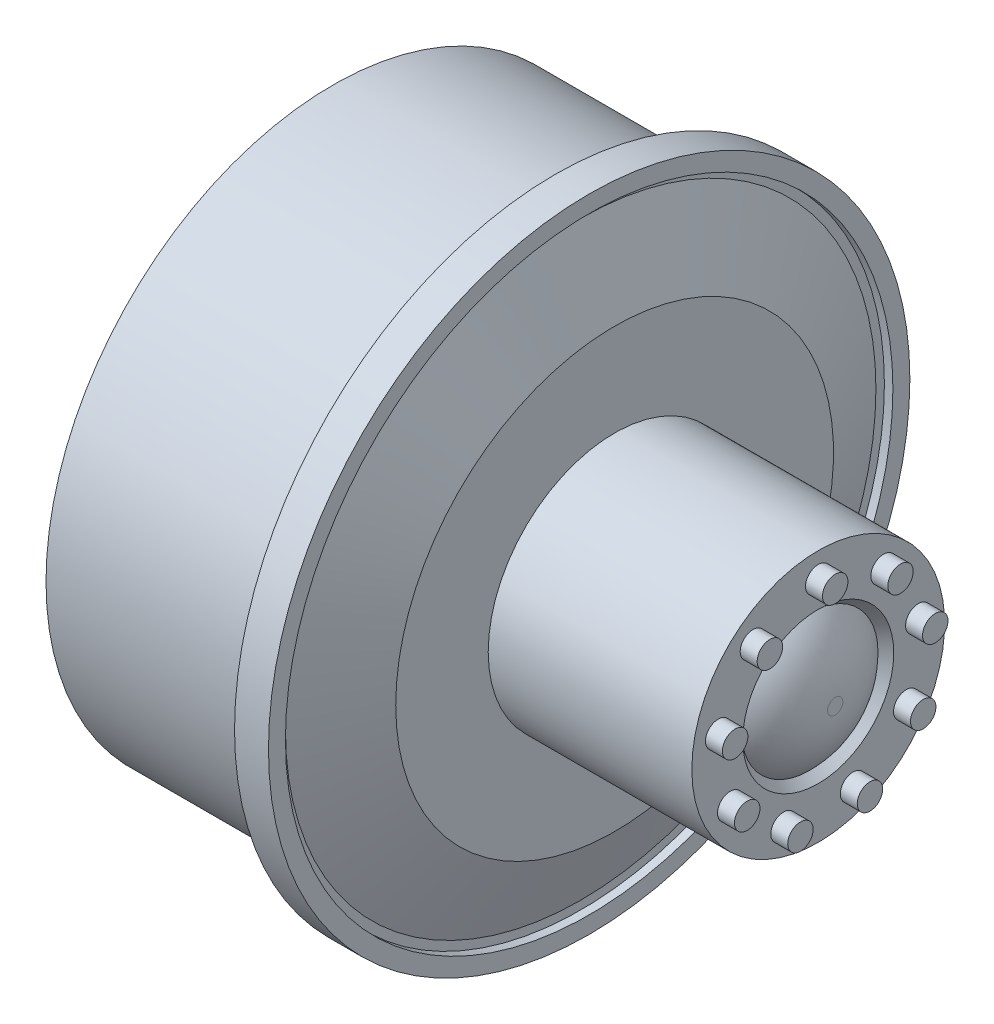
ISO-10303-21;
HEADER;
FILE_DESCRIPTION(('STEP AP214'),'2;1');
FILE_NAME('part.step','',(''),(''),'','','');
FILE_SCHEMA(('AUTOMOTIVE_DESIGN { 1 0 10303 214 1 1 1 1 }'));
ENDSEC;
DATA;
#1=APPLICATION_CONTEXT('core data for automotive mechanical design processes');
#2=APPLICATION_PROTOCOL_DEFINITION('international standard','automotive_design',2000,#1);
#3=PRODUCT_CONTEXT('',#1,'mechanical');
#4=PRODUCT('Part','Part','',(#3));
#5=PRODUCT_RELATED_PRODUCT_CATEGORY('part','',(#4));
#6=PRODUCT_DEFINITION_FORMATION('','',#4);
#7=PRODUCT_DEFINITION_CONTEXT('part definition',#1,'design');
#8=PRODUCT_DEFINITION('design','',#6,#7);
#9=PRODUCT_DEFINITION_SHAPE('','',#8);
#10=(LENGTH_UNIT() NAMED_UNIT(*) SI_UNIT(.MILLI.,.METRE.));
#11=(NAMED_UNIT(*) PLANE_ANGLE_UNIT() SI_UNIT($,.RADIAN.));
#12=(NAMED_UNIT(*) SI_UNIT($,.STERADIAN.) SOLID_ANGLE_UNIT());
#13=UNCERTAINTY_MEASURE_WITH_UNIT(LENGTH_MEASURE(1.E-05),#10,'distance_accuracy_value','');
#14=(GEOMETRIC_REPRESENTATION_CONTEXT(3) GLOBAL_UNCERTAINTY_ASSIGNED_CONTEXT((#13)) GLOBAL_UNIT_ASSIGNED_CONTEXT((#10,
#11,#12)) REPRESENTATION_CONTEXT('',''));
#15=CARTESIAN_POINT('',(0.,0.,0.));
#16=DIRECTION('',(0.,0.,1.));
#17=DIRECTION('',(1.,0.,0.));
#18=AXIS2_PLACEMENT_3D('',#15,#16,#17);
#19=CARTESIAN_POINT('',(-37.2788661687838,0.,0.));
#20=DIRECTION('',(-1.,0.,0.));
#21=DIRECTION('',(0.,0.,1.));
#22=AXIS2_PLACEMENT_3D('',#19,#20,#21);
#23=CYLINDRICAL_SURFACE('',#22,7.45);
#24=CARTESIAN_POINT('',(12.1398131593203,0.,0.));
#25=DIRECTION('',(-1.,0.,0.));
#26=DIRECTION('',(0.,0.,1.));
#27=AXIS2_PLACEMENT_3D('',#24,#25,#26);
#28=CIRCLE('',#27,7.45);
#29=CARTESIAN_POINT('',(12.1398131593203,0.,7.45));
#30=VERTEX_POINT('',#29);
#31=EDGE_CURVE('E99',#30,#30,#28,.T.);
#32=ORIENTED_EDGE('',*,*,#31,.F.);
#33=EDGE_LOOP('',(#32));
#34=FACE_BOUND('',#33,.T.);
#35=CARTESIAN_POINT('',(24.1398131593203,0.,0.));
#36=DIRECTION('',(-1.,0.,0.));
#37=DIRECTION('',(0.,0.,1.));
#38=AXIS2_PLACEMENT_3D('',#35,#36,#37);
#39=CIRCLE('',#38,7.45);
#40=CARTESIAN_POINT('',(24.1398131593203,0.,7.45));
#41=VERTEX_POINT('',#40);
#42=EDGE_CURVE('E69',#41,#41,#39,.T.);
#43=ORIENTED_EDGE('',*,*,#42,.T.);
#44=EDGE_LOOP('',(#43));
#45=FACE_BOUND('',#44,.T.);
#46=ADVANCED_FACE('F31',(#34,#45),#23,.T.);
#47=CARTESIAN_POINT('',(24.1398131593203,0.,-7.45));
#48=DIRECTION('',(-1.,0.,0.));
#49=DIRECTION('',(0.,0.,1.));
#50=AXIS2_PLACEMENT_3D('',#47,#48,#49);
#51=PLANE('',#50);
#52=CARTESIAN_POINT('',(24.1398131593203,4.58711732687269,3.84904845714596));
#53=DIRECTION('',(-1.,0.,0.));
#54=DIRECTION('',(0.,0.,1.));
#55=AXIS2_PLACEMENT_3D('',#52,#53,#54);
#56=CIRCLE('',#55,0.750000000000316);
#57=CARTESIAN_POINT('',(24.1398131593203,4.58711732687269,4.59904845714628));
#58=VERTEX_POINT('',#57);
#59=EDGE_CURVE('E38',#58,#58,#56,.F.);
#60=ORIENTED_EDGE('',*,*,#59,.F.);
#61=EDGE_LOOP('',(#60));
#62=FACE_BOUND('',#61,.T.);
#63=CARTESIAN_POINT('',(24.1398131593203,1.0398150808487,5.8970843637844));
#64=DIRECTION('',(-1.,0.,0.));
#65=DIRECTION('',(0.,0.,1.));
#66=AXIS2_PLACEMENT_3D('',#63,#64,#65);
#67=CIRCLE('',#66,0.750000000000701);
#68=CARTESIAN_POINT('',(24.1398131593203,1.0398150808487,6.64708436378511));
#69=VERTEX_POINT('',#68);
#70=EDGE_CURVE('E42',#69,#69,#67,.F.);
#71=ORIENTED_EDGE('',*,*,#70,.F.);
#72=EDGE_LOOP('',(#71));
#73=FACE_BOUND('',#72,.T.);
#74=CARTESIAN_POINT('',(24.1398131593203,-2.99402819776177,5.18580895781547));
#75=DIRECTION('',(-1.,0.,0.));
#76=DIRECTION('',(0.,0.,1.));
#77=AXIS2_PLACEMENT_3D('',#74,#75,#76);
#78=CIRCLE('',#77,0.750000000001059);
#79=CARTESIAN_POINT('',(24.1398131593203,-2.99402819776177,5.93580895781653));
#80=VERTEX_POINT('',#79);
#81=EDGE_CURVE('E46',#80,#80,#78,.F.);
#82=ORIENTED_EDGE('',*,*,#81,.F.);
#83=EDGE_LOOP('',(#82));
#84=FACE_BOUND('',#83,.T.);
#85=CARTESIAN_POINT('',(24.1398131593203,-5.62693240772256,2.04803590663764));
#86=DIRECTION('',(-1.,0.,0.));
#87=DIRECTION('',(0.,0.,1.));
#88=AXIS2_PLACEMENT_3D('',#85,#86,#87);
#89=CIRCLE('',#88,0.750000000001205);
#90=CARTESIAN_POINT('',(24.1398131593203,-5.62693240772256,2.79803590663884));
#91=VERTEX_POINT('',#90);
#92=EDGE_CURVE('E51',#91,#91,#89,.F.);
#93=ORIENTED_EDGE('',*,*,#92,.F.);
#94=EDGE_LOOP('',(#93));
#95=FACE_BOUND('',#94,.T.);
#96=CARTESIAN_POINT('',(24.1398131593203,-5.62693240772216,-2.04803590663995));
#97=DIRECTION('',(-1.,0.,0.));
#98=DIRECTION('',(0.,0.,1.));
#99=AXIS2_PLACEMENT_3D('',#96,#97,#98);
#100=CIRCLE('',#99,0.750000000001078);
#101=CARTESIAN_POINT('',(24.1398131593203,-5.62693240772216,-1.29803590663887));
#102=VERTEX_POINT('',#101);
#103=EDGE_CURVE('E54',#102,#102,#100,.F.);
#104=ORIENTED_EDGE('',*,*,#103,.F.);
#105=EDGE_LOOP('',(#104));
#106=FACE_BOUND('',#105,.T.);
#107=CARTESIAN_POINT('',(24.1398131593203,-2.99402819776073,-5.18580895781726));
#108=DIRECTION('',(-1.,0.,0.));
#109=DIRECTION('',(0.,0.,1.));
#110=AXIS2_PLACEMENT_3D('',#107,#108,#109);
#111=CIRCLE('',#110,0.75000000000073);
#112=CARTESIAN_POINT('',(24.1398131593203,-2.99402819776073,-4.43580895781653));
#113=VERTEX_POINT('',#112);
#114=EDGE_CURVE('E57',#113,#113,#111,.F.);
#115=ORIENTED_EDGE('',*,*,#114,.F.);
#116=EDGE_LOOP('',(#115));
#117=FACE_BOUND('',#116,.T.);
#118=CARTESIAN_POINT('',(24.1398131593203,1.03981508084988,-5.89708436378539));
#119=DIRECTION('',(-1.,0.,0.));
#120=DIRECTION('',(0.,0.,1.));
#121=AXIS2_PLACEMENT_3D('',#118,#119,#120);
#122=CIRCLE('',#121,0.750000000000317);
#123=CARTESIAN_POINT('',(24.1398131593203,1.03981508084988,-5.14708436378507));
#124=VERTEX_POINT('',#123);
#125=EDGE_CURVE('E60',#124,#124,#122,.F.);
#126=ORIENTED_EDGE('',*,*,#125,.F.);
#127=EDGE_LOOP('',(#126));
#128=FACE_BOUND('',#127,.T.);
#129=CARTESIAN_POINT('',(24.1398131593203,4.58711732687345,-3.84904845714624));
#130=DIRECTION('',(-1.,0.,0.));
#131=DIRECTION('',(0.,0.,1.));
#132=AXIS2_PLACEMENT_3D('',#129,#130,#131);
#133=CIRCLE('',#132,0.75000000000003);
#134=CARTESIAN_POINT('',(24.1398131593203,4.58711732687345,-3.09904845714621));
#135=VERTEX_POINT('',#134);
#136=EDGE_CURVE('E63',#135,#135,#133,.F.);
#137=ORIENTED_EDGE('',*,*,#136,.F.);
#138=EDGE_LOOP('',(#137));
#139=FACE_BOUND('',#138,.T.);
#140=CARTESIAN_POINT('',(24.1398131593203,5.9880563955225,0.));
#141=DIRECTION('',(-1.,0.,0.));
#142=DIRECTION('',(0.,0.,1.));
#143=AXIS2_PLACEMENT_3D('',#140,#141,#142);
#144=CIRCLE('',#143,0.75);
#145=CARTESIAN_POINT('',(24.1398131593203,5.9880563955225,0.75));
#146=VERTEX_POINT('',#145);
#147=EDGE_CURVE('E66',#146,#146,#144,.F.);
#148=ORIENTED_EDGE('',*,*,#147,.F.);
#149=EDGE_LOOP('',(#148));
#150=FACE_BOUND('',#149,.T.);
#151=ORIENTED_EDGE('',*,*,#42,.F.);
#152=EDGE_LOOP('',(#151));
#153=FACE_BOUND('',#152,.T.);
#154=CARTESIAN_POINT('',(24.1398131593203,0.,0.));
#155=DIRECTION('',(-1.,0.,0.));
#156=DIRECTION('',(0.,0.,1.));
#157=AXIS2_PLACEMENT_3D('',#154,#155,#156);
#158=CIRCLE('',#157,4.45);
#159=CARTESIAN_POINT('',(24.1398131593203,0.,4.45));
#160=VERTEX_POINT('',#159);
#161=EDGE_CURVE('E72',#160,#160,#158,.T.);
#162=ORIENTED_EDGE('',*,*,#161,.T.);
#163=EDGE_LOOP('',(#162));
#164=FACE_BOUND('',#163,.T.);
#165=ADVANCED_FACE('F144',(#62,#73,#84,#95,#106,#117,#128,#139,#150,#153,#164),#51,.F.);
#166=CARTESIAN_POINT('',(23.6398131593203,0.,0.));
#167=DIRECTION('',(1.,0.,0.));
#168=DIRECTION('',(0.,0.,-1.));
#169=AXIS2_PLACEMENT_3D('',#166,#167,#168);
#170=CONICAL_SURFACE('',#169,4.02142857142857,0.708626272127667);
#171=ORIENTED_EDGE('',*,*,#161,.F.);
#172=EDGE_LOOP('',(#171));
#173=FACE_BOUND('',#172,.T.);
#174=CARTESIAN_POINT('',(23.6398131593203,0.,0.));
#175=DIRECTION('',(1.,0.,0.));
#176=DIRECTION('',(0.,0.,-1.));
#177=AXIS2_PLACEMENT_3D('',#174,#175,#176);
#178=CIRCLE('',#177,4.02142857142857);
#179=CARTESIAN_POINT('',(23.6398131593203,0.,-4.02142857142857));
#180=VERTEX_POINT('',#179);
#181=EDGE_CURVE('E133',#180,#180,#178,.T.);
#182=ORIENTED_EDGE('',*,*,#181,.F.);
#183=EDGE_LOOP('',(#182));
#184=FACE_BOUND('',#183,.T.);
#185=ADVANCED_FACE('F141',(#173,#184),#170,.F.);
#186=CARTESIAN_POINT('',(-4.47018684067971,0.,-16.9));
#187=DIRECTION('',(1.,0.,0.));
#188=DIRECTION('',(0.,0.,-1.));
#189=AXIS2_PLACEMENT_3D('',#186,#187,#188);
#190=PLANE('',#189);
#191=CARTESIAN_POINT('',(-4.47018684067971,0.,0.));
#192=DIRECTION('',(-1.,0.,0.));
#193=DIRECTION('',(0.,0.,1.));
#194=AXIS2_PLACEMENT_3D('',#191,#192,#193);
#195=CIRCLE('',#194,10.5);
#196=CARTESIAN_POINT('',(-4.47018684067971,0.,10.5));
#197=VERTEX_POINT('',#196);
#198=EDGE_CURVE('E130',#197,#197,#195,.T.);
#199=ORIENTED_EDGE('',*,*,#198,.F.);
#200=EDGE_LOOP('',(#199));
#201=FACE_BOUND('',#200,.T.);
#202=CARTESIAN_POINT('',(-4.47018684067971,0.,0.));
#203=DIRECTION('',(-1.,0.,0.));
#204=DIRECTION('',(0.,0.,1.));
#205=AXIS2_PLACEMENT_3D('',#202,#203,#204);
#206=CIRCLE('',#205,16.9);
#207=CARTESIAN_POINT('',(-4.47018684067971,0.,16.9));
#208=VERTEX_POINT('',#207);
#209=EDGE_CURVE('E75',#208,#208,#206,.T.);
#210=ORIENTED_EDGE('',*,*,#209,.T.);
#211=EDGE_LOOP('',(#210));
#212=FACE_BOUND('',#211,.T.);
#213=ADVANCED_FACE('F143',(#201,#212),#190,.F.);
#214=CARTESIAN_POINT('',(-37.2788661687838,0.,0.));
#215=DIRECTION('',(-1.,0.,0.));
#216=DIRECTION('',(0.,0.,1.));
#217=AXIS2_PLACEMENT_3D('',#214,#215,#216);
#218=CYLINDRICAL_SURFACE('',#217,16.9);
#219=ORIENTED_EDGE('',*,*,#209,.F.);
#220=EDGE_LOOP('',(#219));
#221=FACE_BOUND('',#220,.T.);
#222=CARTESIAN_POINT('',(8.63981315932029,0.,0.));
#223=DIRECTION('',(-1.,0.,0.));
#224=DIRECTION('',(0.,0.,1.));
#225=AXIS2_PLACEMENT_3D('',#222,#223,#224);
#226=CIRCLE('',#225,16.9);
#227=CARTESIAN_POINT('',(8.63981315932029,0.,16.9));
#228=VERTEX_POINT('',#227);
#229=EDGE_CURVE('E78',#228,#228,#226,.T.);
#230=ORIENTED_EDGE('',*,*,#229,.T.);
#231=EDGE_LOOP('',(#230));
#232=FACE_BOUND('',#231,.T.);
#233=ADVANCED_FACE('F151',(#221,#232),#218,.T.);
#234=CARTESIAN_POINT('',(8.63981315932029,0.,-18.9));
#235=DIRECTION('',(1.,0.,0.));
#236=DIRECTION('',(0.,0.,-1.));
#237=AXIS2_PLACEMENT_3D('',#234,#235,#236);
#238=PLANE('',#237);
#239=ORIENTED_EDGE('',*,*,#229,.F.);
#240=EDGE_LOOP('',(#239));
#241=FACE_BOUND('',#240,.T.);
#242=CARTESIAN_POINT('',(8.63981315932029,0.,0.));
#243=DIRECTION('',(-1.,0.,0.));
#244=DIRECTION('',(0.,0.,1.));
#245=AXIS2_PLACEMENT_3D('',#242,#243,#244);
#246=CIRCLE('',#245,18.9);
#247=CARTESIAN_POINT('',(8.63981315932029,0.,18.9));
#248=VERTEX_POINT('',#247);
#249=EDGE_CURVE('E81',#248,#248,#246,.T.);
#250=ORIENTED_EDGE('',*,*,#249,.T.);
#251=EDGE_LOOP('',(#250));
#252=FACE_BOUND('',#251,.T.);
#253=ADVANCED_FACE('F200',(#241,#252),#238,.F.);
#254=CARTESIAN_POINT('',(-37.2788661687838,0.,0.));
#255=DIRECTION('',(-1.,0.,0.));
#256=DIRECTION('',(0.,0.,1.));
#257=AXIS2_PLACEMENT_3D('',#254,#255,#256);
#258=CYLINDRICAL_SURFACE('',#257,18.9);
#259=ORIENTED_EDGE('',*,*,#249,.F.);
#260=EDGE_LOOP('',(#259));
#261=FACE_BOUND('',#260,.T.);
#262=CARTESIAN_POINT('',(10.6398131593203,0.,0.));
#263=DIRECTION('',(-1.,0.,0.));
#264=DIRECTION('',(0.,0.,1.));
#265=AXIS2_PLACEMENT_3D('',#262,#263,#264);
#266=CIRCLE('',#265,18.9);
#267=CARTESIAN_POINT('',(10.6398131593203,0.,18.9));
#268=VERTEX_POINT('',#267);
#269=EDGE_CURVE('E84',#268,#268,#266,.T.);
#270=ORIENTED_EDGE('',*,*,#269,.T.);
#271=EDGE_LOOP('',(#270));
#272=FACE_BOUND('',#271,.T.);
#273=ADVANCED_FACE('F196',(#261,#272),#258,.T.);
#274=CARTESIAN_POINT('',(10.6398131593203,0.,-18.9));
#275=DIRECTION('',(-1.,0.,0.));
#276=DIRECTION('',(0.,0.,1.));
#277=AXIS2_PLACEMENT_3D('',#274,#275,#276);
#278=PLANE('',#277);
#279=ORIENTED_EDGE('',*,*,#269,.F.);
#280=EDGE_LOOP('',(#279));
#281=FACE_BOUND('',#280,.T.);
#282=CARTESIAN_POINT('',(10.6398131593203,0.,0.));
#283=DIRECTION('',(-1.,0.,0.));
#284=DIRECTION('',(0.,0.,1.));
#285=AXIS2_PLACEMENT_3D('',#282,#283,#284);
#286=CIRCLE('',#285,17.9);
#287=CARTESIAN_POINT('',(10.6398131593203,0.,17.9));
#288=VERTEX_POINT('',#287);
#289=EDGE_CURVE('E87',#288,#288,#286,.T.);
#290=ORIENTED_EDGE('',*,*,#289,.T.);
#291=EDGE_LOOP('',(#290));
#292=FACE_BOUND('',#291,.T.);
#293=ADVANCED_FACE('F192',(#281,#292),#278,.F.);
#294=CARTESIAN_POINT('',(-37.2788661687838,0.,0.));
#295=DIRECTION('',(-1.,0.,0.));
#296=DIRECTION('',(0.,0.,1.));
#297=AXIS2_PLACEMENT_3D('',#294,#295,#296);
#298=CYLINDRICAL_SURFACE('',#297,17.9);
#299=ORIENTED_EDGE('',*,*,#289,.F.);
#300=EDGE_LOOP('',(#299));
#301=FACE_BOUND('',#300,.T.);
#302=CARTESIAN_POINT('',(10.1398131593203,0.,0.));
#303=DIRECTION('',(-1.,0.,0.));
#304=DIRECTION('',(0.,0.,1.));
#305=AXIS2_PLACEMENT_3D('',#302,#303,#304);
#306=CIRCLE('',#305,17.9);
#307=CARTESIAN_POINT('',(10.1398131593203,0.,17.9));
#308=VERTEX_POINT('',#307);
#309=EDGE_CURVE('E90',#308,#308,#306,.T.);
#310=ORIENTED_EDGE('',*,*,#309,.T.);
#311=EDGE_LOOP('',(#310));
#312=FACE_BOUND('',#311,.T.);
#313=ADVANCED_FACE('F188',(#301,#312),#298,.F.);
#314=CARTESIAN_POINT('',(10.1398131593203,0.,-17.4));
#315=DIRECTION('',(-1.,0.,0.));
#316=DIRECTION('',(0.,0.,1.));
#317=AXIS2_PLACEMENT_3D('',#314,#315,#316);
#318=PLANE('',#317);
#319=ORIENTED_EDGE('',*,*,#309,.F.);
#320=EDGE_LOOP('',(#319));
#321=FACE_BOUND('',#320,.T.);
#322=CARTESIAN_POINT('',(10.1398131593203,0.,0.));
#323=DIRECTION('',(-1.,0.,0.));
#324=DIRECTION('',(0.,0.,1.));
#325=AXIS2_PLACEMENT_3D('',#322,#323,#324);
#326=CIRCLE('',#325,17.4);
#327=CARTESIAN_POINT('',(10.1398131593203,0.,17.4));
#328=VERTEX_POINT('',#327);
#329=EDGE_CURVE('E93',#328,#328,#326,.T.);
#330=ORIENTED_EDGE('',*,*,#329,.T.);
#331=EDGE_LOOP('',(#330));
#332=FACE_BOUND('',#331,.T.);
#333=ADVANCED_FACE('F180',(#321,#332),#318,.F.);
#334=CARTESIAN_POINT('',(12.1398131593203,0.,0.));
#335=DIRECTION('',(-1.,0.,0.));
#336=DIRECTION('',(0.,0.,1.));
#337=AXIS2_PLACEMENT_3D('',#334,#335,#336);
#338=CONICAL_SURFACE('',#337,12.9,1.15257199721567);
#339=ORIENTED_EDGE('',*,*,#329,.F.);
#340=EDGE_LOOP('',(#339));
#341=FACE_BOUND('',#340,.T.);
#342=CARTESIAN_POINT('',(12.1398131593203,0.,0.));
#343=DIRECTION('',(-1.,0.,0.));
#344=DIRECTION('',(0.,0.,1.));
#345=AXIS2_PLACEMENT_3D('',#342,#343,#344);
#346=CIRCLE('',#345,12.9);
#347=CARTESIAN_POINT('',(12.1398131593203,0.,12.9));
#348=VERTEX_POINT('',#347);
#349=EDGE_CURVE('E96',#348,#348,#346,.T.);
#350=ORIENTED_EDGE('',*,*,#349,.T.);
#351=EDGE_LOOP('',(#350));
#352=FACE_BOUND('',#351,.T.);
#353=ADVANCED_FACE('F170',(#341,#352),#338,.T.);
#354=CARTESIAN_POINT('',(12.1398131593203,0.,-7.45));
#355=DIRECTION('',(-1.,0.,0.));
#356=DIRECTION('',(0.,0.,1.));
#357=AXIS2_PLACEMENT_3D('',#354,#355,#356);
#358=PLANE('',#357);
#359=ORIENTED_EDGE('',*,*,#349,.F.);
#360=EDGE_LOOP('',(#359));
#361=FACE_BOUND('',#360,.T.);
#362=ORIENTED_EDGE('',*,*,#31,.T.);
#363=EDGE_LOOP('',(#362));
#364=FACE_BOUND('',#363,.T.);
#365=ADVANCED_FACE('F167',(#361,#364),#358,.F.);
#366=CARTESIAN_POINT('',(25.1398131593203,5.9880563955225,0.));
#367=DIRECTION('',(-1.,0.,0.));
#368=DIRECTION('',(0.,0.,1.));
#369=AXIS2_PLACEMENT_3D('',#366,#367,#368);
#370=CYLINDRICAL_SURFACE('',#369,0.75);
#371=CARTESIAN_POINT('',(25.1398131593203,5.9880563955225,0.));
#372=DIRECTION('',(1.,0.,0.));
#373=DIRECTION('',(0.,0.,-1.));
#374=AXIS2_PLACEMENT_3D('',#371,#372,#373);
#375=CIRCLE('',#374,0.75);
#376=CARTESIAN_POINT('',(25.1398131593203,5.9880563955225,-0.75));
#377=VERTEX_POINT('',#376);
#378=EDGE_CURVE('E102',#377,#377,#375,.T.);
#379=ORIENTED_EDGE('',*,*,#378,.F.);
#380=EDGE_LOOP('',(#379));
#381=FACE_BOUND('',#380,.T.);
#382=ORIENTED_EDGE('',*,*,#147,.T.);
#383=EDGE_LOOP('',(#382));
#384=FACE_BOUND('',#383,.T.);
#385=ADVANCED_FACE('F169',(#381,#384),#370,.T.);
#386=CARTESIAN_POINT('',(25.1398131593203,5.9880563955225,0.));
#387=DIRECTION('',(1.,0.,0.));
#388=DIRECTION('',(0.,0.,-1.));
#389=AXIS2_PLACEMENT_3D('',#386,#387,#388);
#390=PLANE('',#389);
#391=ORIENTED_EDGE('',*,*,#378,.T.);
#392=EDGE_LOOP('',(#391));
#393=FACE_BOUND('',#392,.T.);
#394=ADVANCED_FACE('F177',(#393),#390,.T.);
#395=CARTESIAN_POINT('',(25.1398131593203,4.58711732687345,-3.84904845714624));
#396=DIRECTION('',(-1.,0.,0.));
#397=DIRECTION('',(0.,0.,1.));
#398=AXIS2_PLACEMENT_3D('',#395,#396,#397);
#399=CYLINDRICAL_SURFACE('',#398,0.75000000000003);
#400=CARTESIAN_POINT('',(25.1398131593203,4.58711732687345,-3.84904845714624));
#401=DIRECTION('',(1.,0.,0.));
#402=DIRECTION('',(0.,0.,-1.));
#403=AXIS2_PLACEMENT_3D('',#400,#401,#402);
#404=CIRCLE('',#403,0.75000000000003);
#405=CARTESIAN_POINT('',(25.1398131593203,4.58711732687345,-4.59904845714627));
#406=VERTEX_POINT('',#405);
#407=EDGE_CURVE('E105',#406,#406,#404,.T.);
#408=ORIENTED_EDGE('',*,*,#407,.F.);
#409=EDGE_LOOP('',(#408));
#410=FACE_BOUND('',#409,.T.);
#411=ORIENTED_EDGE('',*,*,#136,.T.);
#412=EDGE_LOOP('',(#411));
#413=FACE_BOUND('',#412,.T.);
#414=ADVANCED_FACE('F277',(#410,#413),#399,.T.);
#415=CARTESIAN_POINT('',(25.1398131593203,4.58711732687345,-3.84904845714624));
#416=DIRECTION('',(1.,0.,0.));
#417=DIRECTION('',(0.,0.,-1.));
#418=AXIS2_PLACEMENT_3D('',#415,#416,#417);
#419=PLANE('',#418);
#420=ORIENTED_EDGE('',*,*,#407,.T.);
#421=EDGE_LOOP('',(#420));
#422=FACE_BOUND('',#421,.T.);
#423=ADVANCED_FACE('F286',(#422),#419,.T.);
#424=CARTESIAN_POINT('',(25.1398131593203,1.03981508084988,-5.89708436378539));
#425=DIRECTION('',(-1.,0.,0.));
#426=DIRECTION('',(0.,0.,1.));
#427=AXIS2_PLACEMENT_3D('',#424,#425,#426);
#428=CYLINDRICAL_SURFACE('',#427,0.750000000000317);
#429=CARTESIAN_POINT('',(25.1398131593203,1.03981508084988,-5.89708436378539));
#430=DIRECTION('',(1.,0.,0.));
#431=DIRECTION('',(0.,0.,-1.));
#432=AXIS2_PLACEMENT_3D('',#429,#430,#431);
#433=CIRCLE('',#432,0.750000000000317);
#434=CARTESIAN_POINT('',(25.1398131593203,1.03981508084988,-6.6470843637857));
#435=VERTEX_POINT('',#434);
#436=EDGE_CURVE('E108',#435,#435,#433,.T.);
#437=ORIENTED_EDGE('',*,*,#436,.F.);
#438=EDGE_LOOP('',(#437));
#439=FACE_BOUND('',#438,.T.);
#440=ORIENTED_EDGE('',*,*,#125,.T.);
#441=EDGE_LOOP('',(#440));
#442=FACE_BOUND('',#441,.T.);
#443=ADVANCED_FACE('F296',(#439,#442),#428,.T.);
#444=CARTESIAN_POINT('',(25.1398131593203,1.03981508084988,-5.89708436378539));
#445=DIRECTION('',(1.,0.,0.));
#446=DIRECTION('',(0.,0.,-1.));
#447=AXIS2_PLACEMENT_3D('',#444,#445,#446);
#448=PLANE('',#447);
#449=ORIENTED_EDGE('',*,*,#436,.T.);
#450=EDGE_LOOP('',(#449));
#451=FACE_BOUND('',#450,.T.);
#452=ADVANCED_FACE('F306',(#451),#448,.T.);
#453=CARTESIAN_POINT('',(25.1398131593203,-2.99402819776073,-5.18580895781726));
#454=DIRECTION('',(-1.,0.,0.));
#455=DIRECTION('',(0.,0.,1.));
#456=AXIS2_PLACEMENT_3D('',#453,#454,#455);
#457=CYLINDRICAL_SURFACE('',#456,0.75000000000073);
#458=CARTESIAN_POINT('',(25.1398131593203,-2.99402819776073,-5.18580895781726));
#459=DIRECTION('',(1.,0.,0.));
#460=DIRECTION('',(0.,0.,-1.));
#461=AXIS2_PLACEMENT_3D('',#458,#459,#460);
#462=CIRCLE('',#461,0.75000000000073);
#463=CARTESIAN_POINT('',(25.1398131593203,-2.99402819776073,-5.93580895781799));
#464=VERTEX_POINT('',#463);
#465=EDGE_CURVE('E111',#464,#464,#462,.T.);
#466=ORIENTED_EDGE('',*,*,#465,.F.);
#467=EDGE_LOOP('',(#466));
#468=FACE_BOUND('',#467,.T.);
#469=ORIENTED_EDGE('',*,*,#114,.T.);
#470=EDGE_LOOP('',(#469));
#471=FACE_BOUND('',#470,.T.);
#472=ADVANCED_FACE('F316',(#468,#471),#457,.T.);
#473=CARTESIAN_POINT('',(25.1398131593203,-2.99402819776073,-5.18580895781726));
#474=DIRECTION('',(1.,0.,0.));
#475=DIRECTION('',(0.,0.,-1.));
#476=AXIS2_PLACEMENT_3D('',#473,#474,#475);
#477=PLANE('',#476);
#478=ORIENTED_EDGE('',*,*,#465,.T.);
#479=EDGE_LOOP('',(#478));
#480=FACE_BOUND('',#479,.T.);
#481=ADVANCED_FACE('F326',(#480),#477,.T.);
#482=CARTESIAN_POINT('',(25.1398131593203,-5.62693240772216,-2.04803590663995));
#483=DIRECTION('',(-1.,0.,0.));
#484=DIRECTION('',(0.,0.,1.));
#485=AXIS2_PLACEMENT_3D('',#482,#483,#484);
#486=CYLINDRICAL_SURFACE('',#485,0.750000000001078);
#487=CARTESIAN_POINT('',(25.1398131593203,-5.62693240772216,-2.04803590663995));
#488=DIRECTION('',(1.,0.,0.));
#489=DIRECTION('',(0.,0.,-1.));
#490=AXIS2_PLACEMENT_3D('',#487,#488,#489);
#491=CIRCLE('',#490,0.750000000001078);
#492=CARTESIAN_POINT('',(25.1398131593203,-5.62693240772216,-2.79803590664103));
#493=VERTEX_POINT('',#492);
#494=EDGE_CURVE('E114',#493,#493,#491,.T.);
#495=ORIENTED_EDGE('',*,*,#494,.F.);
#496=EDGE_LOOP('',(#495));
#497=FACE_BOUND('',#496,.T.);
#498=ORIENTED_EDGE('',*,*,#103,.T.);
#499=EDGE_LOOP('',(#498));
#500=FACE_BOUND('',#499,.T.);
#501=ADVANCED_FACE('F336',(#497,#500),#486,.T.);
#502=CARTESIAN_POINT('',(25.1398131593203,-5.62693240772216,-2.04803590663995));
#503=DIRECTION('',(1.,0.,0.));
#504=DIRECTION('',(0.,0.,-1.));
#505=AXIS2_PLACEMENT_3D('',#502,#503,#504);
#506=PLANE('',#505);
#507=ORIENTED_EDGE('',*,*,#494,.T.);
#508=EDGE_LOOP('',(#507));
#509=FACE_BOUND('',#508,.T.);
#510=ADVANCED_FACE('F346',(#509),#506,.T.);
#511=CARTESIAN_POINT('',(25.1398131593203,-5.62693240772256,2.04803590663764));
#512=DIRECTION('',(-1.,0.,0.));
#513=DIRECTION('',(0.,0.,1.));
#514=AXIS2_PLACEMENT_3D('',#511,#512,#513);
#515=CYLINDRICAL_SURFACE('',#514,0.750000000001205);
#516=CARTESIAN_POINT('',(25.1398131593203,-5.62693240772256,2.04803590663764));
#517=DIRECTION('',(1.,0.,0.));
#518=DIRECTION('',(0.,0.,-1.));
#519=AXIS2_PLACEMENT_3D('',#516,#517,#518);
#520=CIRCLE('',#519,0.750000000001205);
#521=CARTESIAN_POINT('',(25.1398131593203,-5.62693240772256,1.29803590663643));
#522=VERTEX_POINT('',#521);
#523=EDGE_CURVE('E117',#522,#522,#520,.T.);
#524=ORIENTED_EDGE('',*,*,#523,.F.);
#525=EDGE_LOOP('',(#524));
#526=FACE_BOUND('',#525,.T.);
#527=ORIENTED_EDGE('',*,*,#92,.T.);
#528=EDGE_LOOP('',(#527));
#529=FACE_BOUND('',#528,.T.);
#530=ADVANCED_FACE('F356',(#526,#529),#515,.T.);
#531=CARTESIAN_POINT('',(25.1398131593203,-5.62693240772256,2.04803590663764));
#532=DIRECTION('',(1.,0.,0.));
#533=DIRECTION('',(0.,0.,-1.));
#534=AXIS2_PLACEMENT_3D('',#531,#532,#533);
#535=PLANE('',#534);
#536=ORIENTED_EDGE('',*,*,#523,.T.);
#537=EDGE_LOOP('',(#536));
#538=FACE_BOUND('',#537,.T.);
#539=ADVANCED_FACE('F366',(#538),#535,.T.);
#540=CARTESIAN_POINT('',(25.1398131593203,-2.99402819776177,5.18580895781547));
#541=DIRECTION('',(-1.,0.,0.));
#542=DIRECTION('',(0.,0.,1.));
#543=AXIS2_PLACEMENT_3D('',#540,#541,#542);
#544=CYLINDRICAL_SURFACE('',#543,0.750000000001059);
#545=CARTESIAN_POINT('',(25.1398131593203,-2.99402819776177,5.18580895781547));
#546=DIRECTION('',(1.,0.,0.));
#547=DIRECTION('',(0.,0.,-1.));
#548=AXIS2_PLACEMENT_3D('',#545,#546,#547);
#549=CIRCLE('',#548,0.750000000001059);
#550=CARTESIAN_POINT('',(25.1398131593203,-2.99402819776177,4.43580895781441));
#551=VERTEX_POINT('',#550);
#552=EDGE_CURVE('E120',#551,#551,#549,.T.);
#553=ORIENTED_EDGE('',*,*,#552,.F.);
#554=EDGE_LOOP('',(#553));
#555=FACE_BOUND('',#554,.T.);
#556=ORIENTED_EDGE('',*,*,#81,.T.);
#557=EDGE_LOOP('',(#556));
#558=FACE_BOUND('',#557,.T.);
#559=ADVANCED_FACE('F376',(#555,#558),#544,.T.);
#560=CARTESIAN_POINT('',(25.1398131593203,-2.99402819776177,5.18580895781547));
#561=DIRECTION('',(1.,0.,0.));
#562=DIRECTION('',(0.,0.,-1.));
#563=AXIS2_PLACEMENT_3D('',#560,#561,#562);
#564=PLANE('',#563);
#565=ORIENTED_EDGE('',*,*,#552,.T.);
#566=EDGE_LOOP('',(#565));
#567=FACE_BOUND('',#566,.T.);
#568=ADVANCED_FACE('F386',(#567),#564,.T.);
#569=CARTESIAN_POINT('',(25.1398131593203,1.0398150808487,5.8970843637844));
#570=DIRECTION('',(-1.,0.,0.));
#571=DIRECTION('',(0.,0.,1.));
#572=AXIS2_PLACEMENT_3D('',#569,#570,#571);
#573=CYLINDRICAL_SURFACE('',#572,0.750000000000701);
#574=CARTESIAN_POINT('',(25.1398131593203,1.0398150808487,5.8970843637844));
#575=DIRECTION('',(1.,0.,0.));
#576=DIRECTION('',(0.,0.,-1.));
#577=AXIS2_PLACEMENT_3D('',#574,#575,#576);
#578=CIRCLE('',#577,0.750000000000701);
#579=CARTESIAN_POINT('',(25.1398131593203,1.0398150808487,5.1470843637837));
#580=VERTEX_POINT('',#579);
#581=EDGE_CURVE('E123',#580,#580,#578,.T.);
#582=ORIENTED_EDGE('',*,*,#581,.F.);
#583=EDGE_LOOP('',(#582));
#584=FACE_BOUND('',#583,.T.);
#585=ORIENTED_EDGE('',*,*,#70,.T.);
#586=EDGE_LOOP('',(#585));
#587=FACE_BOUND('',#586,.T.);
#588=ADVANCED_FACE('F396',(#584,#587),#573,.T.);
#589=CARTESIAN_POINT('',(25.1398131593203,1.0398150808487,5.8970843637844));
#590=DIRECTION('',(1.,0.,0.));
#591=DIRECTION('',(0.,0.,-1.));
#592=AXIS2_PLACEMENT_3D('',#589,#590,#591);
#593=PLANE('',#592);
#594=ORIENTED_EDGE('',*,*,#581,.T.);
#595=EDGE_LOOP('',(#594));
#596=FACE_BOUND('',#595,.T.);
#597=ADVANCED_FACE('F406',(#596),#593,.T.);
#598=CARTESIAN_POINT('',(25.1398131593203,4.58711732687269,3.84904845714596));
#599=DIRECTION('',(-1.,0.,0.));
#600=DIRECTION('',(0.,0.,1.));
#601=AXIS2_PLACEMENT_3D('',#598,#599,#600);
#602=CYLINDRICAL_SURFACE('',#601,0.750000000000316);
#603=CARTESIAN_POINT('',(25.1398131593203,4.58711732687269,3.84904845714596));
#604=DIRECTION('',(1.,0.,0.));
#605=DIRECTION('',(0.,0.,-1.));
#606=AXIS2_PLACEMENT_3D('',#603,#604,#605);
#607=CIRCLE('',#606,0.750000000000316);
#608=CARTESIAN_POINT('',(25.1398131593203,4.58711732687269,3.09904845714565));
#609=VERTEX_POINT('',#608);
#610=EDGE_CURVE('E126',#609,#609,#607,.T.);
#611=ORIENTED_EDGE('',*,*,#610,.F.);
#612=EDGE_LOOP('',(#611));
#613=FACE_BOUND('',#612,.T.);
#614=ORIENTED_EDGE('',*,*,#59,.T.);
#615=EDGE_LOOP('',(#614));
#616=FACE_BOUND('',#615,.T.);
#617=ADVANCED_FACE('F416',(#613,#616),#602,.T.);
#618=CARTESIAN_POINT('',(25.1398131593203,4.58711732687269,3.84904845714596));
#619=DIRECTION('',(1.,0.,0.));
#620=DIRECTION('',(0.,0.,-1.));
#621=AXIS2_PLACEMENT_3D('',#618,#619,#620);
#622=PLANE('',#621);
#623=ORIENTED_EDGE('',*,*,#610,.T.);
#624=EDGE_LOOP('',(#623));
#625=FACE_BOUND('',#624,.T.);
#626=ADVANCED_FACE('F426',(#625),#622,.T.);
#627=CARTESIAN_POINT('',(2.52981315932029,0.,0.));
#628=DIRECTION('',(-1.,0.,0.));
#629=DIRECTION('',(0.,0.,1.));
#630=AXIS2_PLACEMENT_3D('',#627,#628,#629);
#631=CYLINDRICAL_SURFACE('',#630,10.5);
#632=CARTESIAN_POINT('',(2.52981315932029,0.,0.));
#633=DIRECTION('',(-1.,0.,0.));
#634=DIRECTION('',(0.,0.,1.));
#635=AXIS2_PLACEMENT_3D('',#632,#633,#634);
#636=CIRCLE('',#635,10.5);
#637=CARTESIAN_POINT('',(2.52981315932029,0.,10.5));
#638=VERTEX_POINT('',#637);
#639=EDGE_CURVE('E129',#638,#638,#636,.T.);
#640=ORIENTED_EDGE('',*,*,#639,.F.);
#641=EDGE_LOOP('',(#640));
#642=FACE_BOUND('',#641,.T.);
#643=ORIENTED_EDGE('',*,*,#198,.T.);
#644=EDGE_LOOP('',(#643));
#645=FACE_BOUND('',#644,.T.);
#646=ADVANCED_FACE('F435',(#642,#645),#631,.F.);
#647=CARTESIAN_POINT('',(2.52981315932029,0.,0.));
#648=DIRECTION('',(-1.,0.,0.));
#649=DIRECTION('',(0.,0.,1.));
#650=AXIS2_PLACEMENT_3D('',#647,#648,#649);
#651=PLANE('',#650);
#652=ORIENTED_EDGE('',*,*,#639,.T.);
#653=EDGE_LOOP('',(#652));
#654=FACE_BOUND('',#653,.T.);
#655=ADVANCED_FACE('F450',(#654),#651,.T.);
#656=CARTESIAN_POINT('',(25.1398131593203,0.,0.));
#657=DIRECTION('',(1.,0.,0.));
#658=DIRECTION('',(0.,0.,-1.));
#659=AXIS2_PLACEMENT_3D('',#656,#657,#658);
#660=PLANE('',#659);
#661=CARTESIAN_POINT('',(25.1398131593203,0.,0.));
#662=DIRECTION('',(1.,0.,0.));
#663=DIRECTION('',(0.,0.,-1.));
#664=AXIS2_PLACEMENT_3D('',#661,#662,#663);
#665=CIRCLE('',#664,0.450714357157144);
#666=CARTESIAN_POINT('',(25.1398131593203,0.,-0.450714357157144));
#667=VERTEX_POINT('',#666);
#668=EDGE_CURVE('E10',#667,#667,#665,.T.);
#669=ORIENTED_EDGE('',*,*,#668,.T.);
#670=EDGE_LOOP('',(#669));
#671=FACE_BOUND('',#670,.T.);
#672=ADVANCED_FACE('F460',(#671),#660,.T.);
#673=CARTESIAN_POINT('',(20.1398131593203,0.,0.));
#674=DIRECTION('',(-1.,0.,0.));
#675=DIRECTION('',(0.,0.,1.));
#676=AXIS2_PLACEMENT_3D('',#673,#674,#675);
#677=DEGENERATE_TOROIDAL_SURFACE('',#676,0.450714357157144,5.,.T.);
#678=ORIENTED_EDGE('',*,*,#181,.T.);
#679=EDGE_LOOP('',(#678));
#680=FACE_BOUND('',#679,.T.);
#681=ORIENTED_EDGE('',*,*,#668,.F.);
#682=EDGE_LOOP('',(#681));
#683=FACE_BOUND('',#682,.T.);
#684=ADVANCED_FACE('F33',(#680,#683),#677,.T.);
#685=CLOSED_SHELL('',(#46,#165,#185,#213,#233,#253,#273,#293,#313,#333,#353,#365,#385,#394,#414,
#423,#443,#452,#472,#481,#501,#510,#530,#539,#559,#568,#588,#597,#617,#626,#646,#655,#672,#684));
#686=MANIFOLD_SOLID_BREP('B2',#685);
#687=ADVANCED_BREP_SHAPE_REPRESENTATION('',(#18,#686),#14);
#688=SHAPE_DEFINITION_REPRESENTATION(#9,#687);
ENDSEC;
END-ISO-10303-21;
